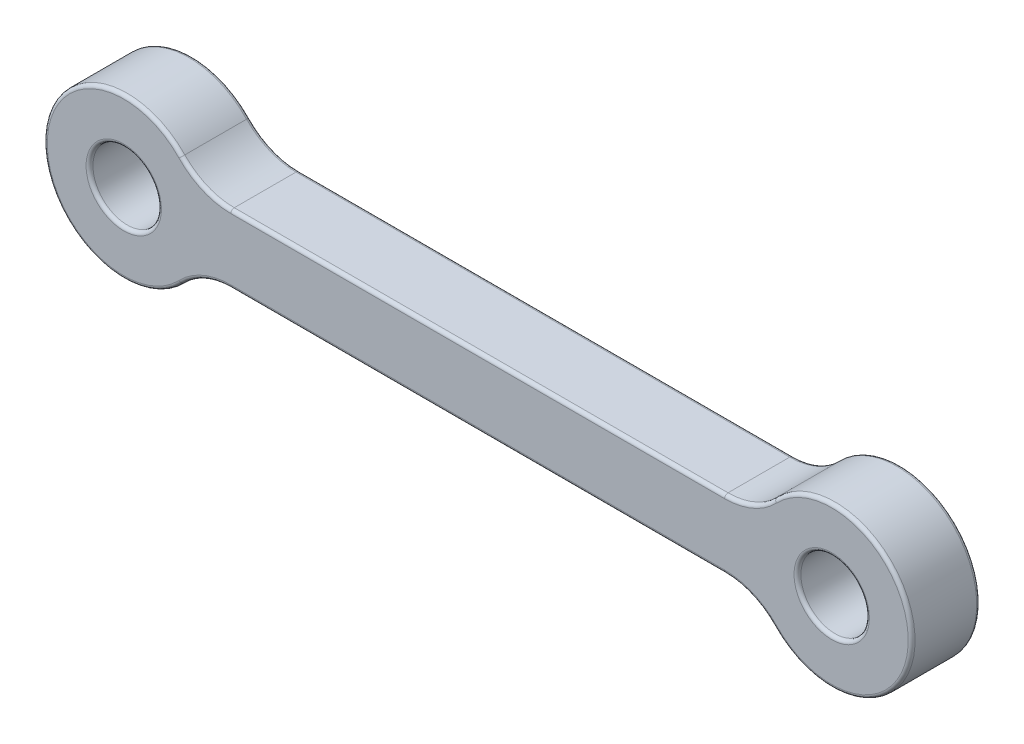
ISO-10303-21;
HEADER;
FILE_DESCRIPTION(('STEP AP214'),'2;1');
FILE_NAME('part.step','',(''),(''),'','','');
FILE_SCHEMA(('AUTOMOTIVE_DESIGN { 1 0 10303 214 1 1 1 1 }'));
ENDSEC;
DATA;
#1=APPLICATION_CONTEXT('core data for automotive mechanical design processes');
#2=APPLICATION_PROTOCOL_DEFINITION('international standard','automotive_design',2000,#1);
#3=PRODUCT_CONTEXT('',#1,'mechanical');
#4=PRODUCT('Part','Part','',(#3));
#5=PRODUCT_RELATED_PRODUCT_CATEGORY('part','',(#4));
#6=PRODUCT_DEFINITION_FORMATION('','',#4);
#7=PRODUCT_DEFINITION_CONTEXT('part definition',#1,'design');
#8=PRODUCT_DEFINITION('design','',#6,#7);
#9=PRODUCT_DEFINITION_SHAPE('','',#8);
#10=(LENGTH_UNIT() NAMED_UNIT(*) SI_UNIT(.MILLI.,.METRE.));
#11=(NAMED_UNIT(*) PLANE_ANGLE_UNIT() SI_UNIT($,.RADIAN.));
#12=(NAMED_UNIT(*) SI_UNIT($,.STERADIAN.) SOLID_ANGLE_UNIT());
#13=UNCERTAINTY_MEASURE_WITH_UNIT(LENGTH_MEASURE(1.E-05),#10,'distance_accuracy_value','');
#14=(GEOMETRIC_REPRESENTATION_CONTEXT(3) GLOBAL_UNCERTAINTY_ASSIGNED_CONTEXT((#13)) GLOBAL_UNIT_ASSIGNED_CONTEXT((#10,
#11,#12)) REPRESENTATION_CONTEXT('',''));
#15=CARTESIAN_POINT('',(0.,0.,0.));
#16=DIRECTION('',(0.,0.,1.));
#17=DIRECTION('',(1.,0.,0.));
#18=AXIS2_PLACEMENT_3D('',#15,#16,#17);
#19=CARTESIAN_POINT('',(0.,1.5,1.5));
#20=DIRECTION('',(0.,-1.,0.));
#21=DIRECTION('',(0.,0.,-1.));
#22=AXIS2_PLACEMENT_3D('',#19,#20,#21);
#23=PLANE('',#22);
#24=DIRECTION('',(0.,0.,-1.));
#25=VECTOR('',#24,1.);
#26=CARTESIAN_POINT('',(26.3095842401766,1.5,1.5));
#27=LINE('',#26,#25);
#28=CARTESIAN_POINT('',(26.3095842401766,1.5,1.35));
#29=VERTEX_POINT('',#28);
#30=CARTESIAN_POINT('',(26.3095842401766,1.5,-1.35));
#31=VERTEX_POINT('',#30);
#32=EDGE_CURVE('E302',#29,#31,#27,.T.);
#33=ORIENTED_EDGE('',*,*,#32,.T.);
#34=DIRECTION('',(-1.,0.,0.));
#35=VECTOR('',#34,1.);
#36=CARTESIAN_POINT('',(0.,1.5,-1.35));
#37=LINE('',#36,#35);
#38=CARTESIAN_POINT('',(4.69041575982343,1.5,-1.35));
#39=VERTEX_POINT('',#38);
#40=EDGE_CURVE('E224',#31,#39,#37,.T.);
#41=ORIENTED_EDGE('',*,*,#40,.T.);
#42=DIRECTION('',(0.,0.,1.));
#43=VECTOR('',#42,1.);
#44=CARTESIAN_POINT('',(4.69041575982343,1.5,1.5));
#45=LINE('',#44,#43);
#46=CARTESIAN_POINT('',(4.69041575982343,1.5,1.35));
#47=VERTEX_POINT('',#46);
#48=EDGE_CURVE('E296',#39,#47,#45,.T.);
#49=ORIENTED_EDGE('',*,*,#48,.T.);
#50=DIRECTION('',(-1.,0.,0.));
#51=VECTOR('',#50,1.);
#52=CARTESIAN_POINT('',(26.3095842401766,1.5,1.35));
#53=LINE('',#52,#51);
#54=EDGE_CURVE('E222',#47,#29,#53,.F.);
#55=ORIENTED_EDGE('',*,*,#54,.T.);
#56=EDGE_LOOP('',(#33,#41,#49,#55));
#57=FACE_BOUND('',#56,.T.);
#58=ADVANCED_FACE('F36',(#57),#23,.F.);
#59=CARTESIAN_POINT('',(0.,0.,1.5));
#60=DIRECTION('',(0.,0.,-1.));
#61=DIRECTION('',(-1.,0.,0.));
#62=AXIS2_PLACEMENT_3D('',#59,#60,#61);
#63=CYLINDRICAL_SURFACE('',#62,3.5);
#64=DIRECTION('',(0.,0.,-1.));
#65=VECTOR('',#64,1.);
#66=CARTESIAN_POINT('',(2.52560848605877,2.42307692307692,1.5));
#67=LINE('',#66,#65);
#68=CARTESIAN_POINT('',(2.52560848605877,2.42307692307692,1.35));
#69=VERTEX_POINT('',#68);
#70=CARTESIAN_POINT('',(2.52560848605877,2.42307692307692,-1.35));
#71=VERTEX_POINT('',#70);
#72=EDGE_CURVE('E298',#69,#71,#67,.T.);
#73=ORIENTED_EDGE('',*,*,#72,.T.);
#74=CARTESIAN_POINT('',(0.,0.,-1.35));
#75=DIRECTION('',(0.,0.,1.));
#76=DIRECTION('',(1.,0.,0.));
#77=AXIS2_PLACEMENT_3D('',#74,#75,#76);
#78=CIRCLE('',#77,3.5);
#79=CARTESIAN_POINT('',(2.52560848605877,-2.42307692307692,-1.35));
#80=VERTEX_POINT('',#79);
#81=EDGE_CURVE('E199',#71,#80,#78,.T.);
#82=ORIENTED_EDGE('',*,*,#81,.T.);
#83=DIRECTION('',(0.,0.,-1.));
#84=VECTOR('',#83,1.);
#85=CARTESIAN_POINT('',(2.52560848605877,-2.42307692307692,1.5));
#86=LINE('',#85,#84);
#87=CARTESIAN_POINT('',(2.52560848605877,-2.42307692307692,1.35));
#88=VERTEX_POINT('',#87);
#89=EDGE_CURVE('E303',#80,#88,#86,.F.);
#90=ORIENTED_EDGE('',*,*,#89,.T.);
#91=CARTESIAN_POINT('',(0.,0.,1.35));
#92=DIRECTION('',(0.,0.,1.));
#93=DIRECTION('',(1.,0.,0.));
#94=AXIS2_PLACEMENT_3D('',#91,#92,#93);
#95=CIRCLE('',#94,3.5);
#96=EDGE_CURVE('E197',#88,#69,#95,.F.);
#97=ORIENTED_EDGE('',*,*,#96,.T.);
#98=EDGE_LOOP('',(#73,#82,#90,#97));
#99=FACE_BOUND('',#98,.T.);
#100=ADVANCED_FACE('F333',(#99),#63,.T.);
#101=CARTESIAN_POINT('',(0.,-1.5,1.5));
#102=DIRECTION('',(0.,-1.,0.));
#103=DIRECTION('',(0.,0.,-1.));
#104=AXIS2_PLACEMENT_3D('',#101,#102,#103);
#105=PLANE('',#104);
#106=DIRECTION('',(0.,0.,-1.));
#107=VECTOR('',#106,1.);
#108=CARTESIAN_POINT('',(4.69041575982343,-1.5,1.5));
#109=LINE('',#108,#107);
#110=CARTESIAN_POINT('',(4.69041575982343,-1.5,1.35));
#111=VERTEX_POINT('',#110);
#112=CARTESIAN_POINT('',(4.69041575982343,-1.5,-1.35));
#113=VERTEX_POINT('',#112);
#114=EDGE_CURVE('E336',#111,#113,#109,.T.);
#115=ORIENTED_EDGE('',*,*,#114,.T.);
#116=DIRECTION('',(-1.,0.,0.));
#117=VECTOR('',#116,1.);
#118=CARTESIAN_POINT('',(26.3095842401766,-1.5,-1.35));
#119=LINE('',#118,#117);
#120=CARTESIAN_POINT('',(26.3095842401766,-1.5,-1.35));
#121=VERTEX_POINT('',#120);
#122=EDGE_CURVE('E207',#113,#121,#119,.F.);
#123=ORIENTED_EDGE('',*,*,#122,.T.);
#124=DIRECTION('',(0.,0.,1.));
#125=VECTOR('',#124,1.);
#126=CARTESIAN_POINT('',(26.3095842401766,-1.5,1.5));
#127=LINE('',#126,#125);
#128=CARTESIAN_POINT('',(26.3095842401766,-1.5,1.35));
#129=VERTEX_POINT('',#128);
#130=EDGE_CURVE('E334',#121,#129,#127,.T.);
#131=ORIENTED_EDGE('',*,*,#130,.T.);
#132=DIRECTION('',(-1.,0.,0.));
#133=VECTOR('',#132,1.);
#134=CARTESIAN_POINT('',(0.,-1.5,1.35));
#135=LINE('',#134,#133);
#136=EDGE_CURVE('E205',#129,#111,#135,.T.);
#137=ORIENTED_EDGE('',*,*,#136,.T.);
#138=EDGE_LOOP('',(#115,#123,#131,#137));
#139=FACE_BOUND('',#138,.T.);
#140=ADVANCED_FACE('F372',(#139),#105,.T.);
#141=CARTESIAN_POINT('',(0.,0.,1.5));
#142=DIRECTION('',(0.,0.,-1.));
#143=DIRECTION('',(-1.,0.,0.));
#144=AXIS2_PLACEMENT_3D('',#141,#142,#143);
#145=CYLINDRICAL_SURFACE('',#144,1.5);
#146=CARTESIAN_POINT('',(0.,0.,-1.35));
#147=DIRECTION('',(0.,0.,1.));
#148=DIRECTION('',(1.,0.,0.));
#149=AXIS2_PLACEMENT_3D('',#146,#147,#148);
#150=CIRCLE('',#149,1.5);
#151=CARTESIAN_POINT('',(1.5,0.,-1.35));
#152=VERTEX_POINT('',#151);
#153=EDGE_CURVE('E191',#152,#152,#150,.F.);
#154=ORIENTED_EDGE('',*,*,#153,.T.);
#155=EDGE_LOOP('',(#154));
#156=FACE_BOUND('',#155,.T.);
#157=CARTESIAN_POINT('',(0.,0.,1.35));
#158=DIRECTION('',(0.,0.,1.));
#159=DIRECTION('',(1.,0.,0.));
#160=AXIS2_PLACEMENT_3D('',#157,#158,#159);
#161=CIRCLE('',#160,1.5);
#162=CARTESIAN_POINT('',(1.5,0.,1.35));
#163=VERTEX_POINT('',#162);
#164=EDGE_CURVE('E188',#163,#163,#161,.T.);
#165=ORIENTED_EDGE('',*,*,#164,.T.);
#166=EDGE_LOOP('',(#165));
#167=FACE_BOUND('',#166,.T.);
#168=ADVANCED_FACE('F639',(#156,#167),#145,.F.);
#169=CARTESIAN_POINT('',(31.,0.,1.5));
#170=DIRECTION('',(0.,0.,-1.));
#171=DIRECTION('',(-1.,0.,0.));
#172=AXIS2_PLACEMENT_3D('',#169,#170,#171);
#173=CYLINDRICAL_SURFACE('',#172,3.5);
#174=DIRECTION('',(0.,0.,-1.));
#175=VECTOR('',#174,1.);
#176=CARTESIAN_POINT('',(28.4743915139412,-2.42307692307692,1.5));
#177=LINE('',#176,#175);
#178=CARTESIAN_POINT('',(28.4743915139412,-2.42307692307692,1.35));
#179=VERTEX_POINT('',#178);
#180=CARTESIAN_POINT('',(28.4743915139412,-2.42307692307692,-1.35));
#181=VERTEX_POINT('',#180);
#182=EDGE_CURVE('E341',#179,#181,#177,.T.);
#183=ORIENTED_EDGE('',*,*,#182,.T.);
#184=CARTESIAN_POINT('',(31.,0.,-1.35));
#185=DIRECTION('',(0.,0.,1.));
#186=DIRECTION('',(1.,0.,0.));
#187=AXIS2_PLACEMENT_3D('',#184,#185,#186);
#188=CIRCLE('',#187,3.5);
#189=CARTESIAN_POINT('',(28.4743915139412,2.42307692307692,-1.35));
#190=VERTEX_POINT('',#189);
#191=EDGE_CURVE('E216',#181,#190,#188,.T.);
#192=ORIENTED_EDGE('',*,*,#191,.T.);
#193=DIRECTION('',(0.,0.,-1.));
#194=VECTOR('',#193,1.);
#195=CARTESIAN_POINT('',(28.4743915139412,2.42307692307692,1.5));
#196=LINE('',#195,#194);
#197=CARTESIAN_POINT('',(28.4743915139412,2.42307692307692,1.35));
#198=VERTEX_POINT('',#197);
#199=EDGE_CURVE('E259',#190,#198,#196,.F.);
#200=ORIENTED_EDGE('',*,*,#199,.T.);
#201=CARTESIAN_POINT('',(31.,0.,1.35));
#202=DIRECTION('',(0.,0.,1.));
#203=DIRECTION('',(1.,0.,0.));
#204=AXIS2_PLACEMENT_3D('',#201,#202,#203);
#205=CIRCLE('',#204,3.5);
#206=EDGE_CURVE('E214',#198,#179,#205,.F.);
#207=ORIENTED_EDGE('',*,*,#206,.T.);
#208=EDGE_LOOP('',(#183,#192,#200,#207));
#209=FACE_BOUND('',#208,.T.);
#210=ADVANCED_FACE('F348',(#209),#173,.T.);
#211=CARTESIAN_POINT('',(31.,0.,1.5));
#212=DIRECTION('',(0.,0.,-1.));
#213=DIRECTION('',(-1.,0.,0.));
#214=AXIS2_PLACEMENT_3D('',#211,#212,#213);
#215=CYLINDRICAL_SURFACE('',#214,1.5);
#216=CARTESIAN_POINT('',(31.,0.,-1.35));
#217=DIRECTION('',(0.,0.,1.));
#218=DIRECTION('',(1.,0.,0.));
#219=AXIS2_PLACEMENT_3D('',#216,#217,#218);
#220=CIRCLE('',#219,1.5);
#221=CARTESIAN_POINT('',(32.5,0.,-1.35));
#222=VERTEX_POINT('',#221);
#223=EDGE_CURVE('E171',#222,#222,#220,.F.);
#224=ORIENTED_EDGE('',*,*,#223,.T.);
#225=EDGE_LOOP('',(#224));
#226=FACE_BOUND('',#225,.T.);
#227=CARTESIAN_POINT('',(31.,0.,1.35));
#228=DIRECTION('',(0.,0.,1.));
#229=DIRECTION('',(1.,0.,0.));
#230=AXIS2_PLACEMENT_3D('',#227,#228,#229);
#231=CIRCLE('',#230,1.5);
#232=CARTESIAN_POINT('',(32.5,0.,1.35));
#233=VERTEX_POINT('',#232);
#234=EDGE_CURVE('E305',#233,#233,#231,.T.);
#235=ORIENTED_EDGE('',*,*,#234,.T.);
#236=EDGE_LOOP('',(#235));
#237=FACE_BOUND('',#236,.T.);
#238=ADVANCED_FACE('F617',(#226,#237),#215,.F.);
#239=CARTESIAN_POINT('',(0.,0.,1.5));
#240=DIRECTION('',(0.,0.,1.));
#241=DIRECTION('',(1.,0.,0.));
#242=AXIS2_PLACEMENT_3D('',#239,#240,#241);
#243=PLANE('',#242);
#244=CARTESIAN_POINT('',(31.,0.,1.5));
#245=DIRECTION('',(0.,0.,1.));
#246=DIRECTION('',(1.,0.,0.));
#247=AXIS2_PLACEMENT_3D('',#244,#245,#246);
#248=CIRCLE('',#247,1.65);
#249=CARTESIAN_POINT('',(32.65,0.,1.5));
#250=VERTEX_POINT('',#249);
#251=EDGE_CURVE('E11',#250,#250,#248,.F.);
#252=ORIENTED_EDGE('',*,*,#251,.T.);
#253=EDGE_LOOP('',(#252));
#254=FACE_BOUND('',#253,.T.);
#255=CARTESIAN_POINT('',(0.,0.,1.5));
#256=DIRECTION('',(0.,0.,1.));
#257=DIRECTION('',(1.,0.,0.));
#258=AXIS2_PLACEMENT_3D('',#255,#256,#257);
#259=CIRCLE('',#258,1.65);
#260=CARTESIAN_POINT('',(1.65,0.,1.5));
#261=VERTEX_POINT('',#260);
#262=EDGE_CURVE('E45',#261,#261,#259,.F.);
#263=ORIENTED_EDGE('',*,*,#262,.T.);
#264=EDGE_LOOP('',(#263));
#265=FACE_BOUND('',#264,.T.);
#266=DIRECTION('',(-1.,0.,0.));
#267=VECTOR('',#266,1.);
#268=CARTESIAN_POINT('',(0.,-1.35,1.5));
#269=LINE('',#268,#267);
#270=CARTESIAN_POINT('',(4.69041575982343,-1.35,1.5));
#271=VERTEX_POINT('',#270);
#272=CARTESIAN_POINT('',(26.3095842401766,-1.35,1.5));
#273=VERTEX_POINT('',#272);
#274=EDGE_CURVE('E53',#271,#273,#269,.F.);
#275=ORIENTED_EDGE('',*,*,#274,.T.);
#276=CARTESIAN_POINT('',(26.3095842401766,-4.5,1.5));
#277=DIRECTION('',(0.,0.,1.));
#278=DIRECTION('',(1.,0.,0.));
#279=AXIS2_PLACEMENT_3D('',#276,#277,#278);
#280=CIRCLE('',#279,3.15);
#281=CARTESIAN_POINT('',(28.5826318776295,-2.31923076923077,1.5));
#282=VERTEX_POINT('',#281);
#283=EDGE_CURVE('E238',#273,#282,#280,.F.);
#284=ORIENTED_EDGE('',*,*,#283,.T.);
#285=CARTESIAN_POINT('',(31.,0.,1.5));
#286=DIRECTION('',(0.,0.,1.));
#287=DIRECTION('',(1.,0.,0.));
#288=AXIS2_PLACEMENT_3D('',#285,#286,#287);
#289=CIRCLE('',#288,3.35);
#290=CARTESIAN_POINT('',(28.5826318776295,2.31923076923077,1.5));
#291=VERTEX_POINT('',#290);
#292=EDGE_CURVE('E226',#282,#291,#289,.T.);
#293=ORIENTED_EDGE('',*,*,#292,.T.);
#294=CARTESIAN_POINT('',(26.3095842401766,4.5,1.5));
#295=DIRECTION('',(0.,0.,1.));
#296=DIRECTION('',(1.,0.,0.));
#297=AXIS2_PLACEMENT_3D('',#294,#295,#296);
#298=CIRCLE('',#297,3.15);
#299=CARTESIAN_POINT('',(26.3095842401766,1.35,1.5));
#300=VERTEX_POINT('',#299);
#301=EDGE_CURVE('E228',#291,#300,#298,.F.);
#302=ORIENTED_EDGE('',*,*,#301,.T.);
#303=DIRECTION('',(-1.,0.,0.));
#304=VECTOR('',#303,1.);
#305=CARTESIAN_POINT('',(4.69041575982343,1.35,1.5));
#306=LINE('',#305,#304);
#307=CARTESIAN_POINT('',(4.69041575982343,1.35,1.5));
#308=VERTEX_POINT('',#307);
#309=EDGE_CURVE('E230',#300,#308,#306,.T.);
#310=ORIENTED_EDGE('',*,*,#309,.T.);
#311=CARTESIAN_POINT('',(4.69041575982343,4.5,1.5));
#312=DIRECTION('',(0.,0.,1.));
#313=DIRECTION('',(1.,0.,0.));
#314=AXIS2_PLACEMENT_3D('',#311,#312,#313);
#315=CIRCLE('',#314,3.15);
#316=CARTESIAN_POINT('',(2.41736812237054,2.31923076923077,1.5));
#317=VERTEX_POINT('',#316);
#318=EDGE_CURVE('E232',#308,#317,#315,.F.);
#319=ORIENTED_EDGE('',*,*,#318,.T.);
#320=CARTESIAN_POINT('',(0.,0.,1.5));
#321=DIRECTION('',(0.,0.,1.));
#322=DIRECTION('',(1.,0.,0.));
#323=AXIS2_PLACEMENT_3D('',#320,#321,#322);
#324=CIRCLE('',#323,3.35);
#325=CARTESIAN_POINT('',(2.41736812237054,-2.31923076923077,1.5));
#326=VERTEX_POINT('',#325);
#327=EDGE_CURVE('E234',#317,#326,#324,.T.);
#328=ORIENTED_EDGE('',*,*,#327,.T.);
#329=CARTESIAN_POINT('',(4.69041575982343,-4.5,1.5));
#330=DIRECTION('',(0.,0.,1.));
#331=DIRECTION('',(1.,0.,0.));
#332=AXIS2_PLACEMENT_3D('',#329,#330,#331);
#333=CIRCLE('',#332,3.15);
#334=EDGE_CURVE('E58',#326,#271,#333,.F.);
#335=ORIENTED_EDGE('',*,*,#334,.T.);
#336=EDGE_LOOP('',(#275,#284,#293,#302,#310,#319,#328,#335));
#337=FACE_BOUND('',#336,.T.);
#338=ADVANCED_FACE('F391',(#254,#265,#337),#243,.T.);
#339=CARTESIAN_POINT('',(0.,0.,-1.5));
#340=DIRECTION('',(0.,0.,1.));
#341=DIRECTION('',(1.,0.,0.));
#342=AXIS2_PLACEMENT_3D('',#339,#340,#341);
#343=PLANE('',#342);
#344=CARTESIAN_POINT('',(31.,0.,-1.5));
#345=DIRECTION('',(0.,0.,1.));
#346=DIRECTION('',(1.,0.,0.));
#347=AXIS2_PLACEMENT_3D('',#344,#345,#346);
#348=CIRCLE('',#347,1.65);
#349=CARTESIAN_POINT('',(32.65,0.,-1.5));
#350=VERTEX_POINT('',#349);
#351=EDGE_CURVE('E180',#350,#350,#348,.T.);
#352=ORIENTED_EDGE('',*,*,#351,.T.);
#353=EDGE_LOOP('',(#352));
#354=FACE_BOUND('',#353,.T.);
#355=CARTESIAN_POINT('',(0.,0.,-1.5));
#356=DIRECTION('',(0.,0.,1.));
#357=DIRECTION('',(1.,0.,0.));
#358=AXIS2_PLACEMENT_3D('',#355,#356,#357);
#359=CIRCLE('',#358,1.65);
#360=CARTESIAN_POINT('',(1.65,0.,-1.5));
#361=VERTEX_POINT('',#360);
#362=EDGE_CURVE('E177',#361,#361,#359,.T.);
#363=ORIENTED_EDGE('',*,*,#362,.T.);
#364=EDGE_LOOP('',(#363));
#365=FACE_BOUND('',#364,.T.);
#366=CARTESIAN_POINT('',(0.,0.,-1.5));
#367=DIRECTION('',(0.,0.,1.));
#368=DIRECTION('',(1.,0.,0.));
#369=AXIS2_PLACEMENT_3D('',#366,#367,#368);
#370=CIRCLE('',#369,3.35);
#371=CARTESIAN_POINT('',(2.41736812237054,-2.31923076923077,-1.5));
#372=VERTEX_POINT('',#371);
#373=CARTESIAN_POINT('',(2.41736812237054,2.31923076923077,-1.5));
#374=VERTEX_POINT('',#373);
#375=EDGE_CURVE('E175',#372,#374,#370,.F.);
#376=ORIENTED_EDGE('',*,*,#375,.T.);
#377=CARTESIAN_POINT('',(4.69041575982343,4.5,-1.5));
#378=DIRECTION('',(0.,0.,1.));
#379=DIRECTION('',(1.,0.,0.));
#380=AXIS2_PLACEMENT_3D('',#377,#378,#379);
#381=CIRCLE('',#380,3.15);
#382=CARTESIAN_POINT('',(4.69041575982343,1.35,-1.5));
#383=VERTEX_POINT('',#382);
#384=EDGE_CURVE('E156',#374,#383,#381,.T.);
#385=ORIENTED_EDGE('',*,*,#384,.T.);
#386=DIRECTION('',(-1.,0.,0.));
#387=VECTOR('',#386,1.);
#388=CARTESIAN_POINT('',(0.,1.35,-1.5));
#389=LINE('',#388,#387);
#390=CARTESIAN_POINT('',(26.3095842401766,1.35,-1.5));
#391=VERTEX_POINT('',#390);
#392=EDGE_CURVE('E164',#383,#391,#389,.F.);
#393=ORIENTED_EDGE('',*,*,#392,.T.);
#394=CARTESIAN_POINT('',(26.3095842401766,4.5,-1.5));
#395=DIRECTION('',(0.,0.,1.));
#396=DIRECTION('',(1.,0.,0.));
#397=AXIS2_PLACEMENT_3D('',#394,#395,#396);
#398=CIRCLE('',#397,3.15);
#399=CARTESIAN_POINT('',(28.5826318776295,2.31923076923077,-1.5));
#400=VERTEX_POINT('',#399);
#401=EDGE_CURVE('E170',#391,#400,#398,.T.);
#402=ORIENTED_EDGE('',*,*,#401,.T.);
#403=CARTESIAN_POINT('',(31.,0.,-1.5));
#404=DIRECTION('',(0.,0.,1.));
#405=DIRECTION('',(1.,0.,0.));
#406=AXIS2_PLACEMENT_3D('',#403,#404,#405);
#407=CIRCLE('',#406,3.35);
#408=CARTESIAN_POINT('',(28.5826318776295,-2.31923076923077,-1.5));
#409=VERTEX_POINT('',#408);
#410=EDGE_CURVE('E316',#400,#409,#407,.F.);
#411=ORIENTED_EDGE('',*,*,#410,.T.);
#412=CARTESIAN_POINT('',(26.3095842401766,-4.5,-1.5));
#413=DIRECTION('',(0.,0.,1.));
#414=DIRECTION('',(1.,0.,0.));
#415=AXIS2_PLACEMENT_3D('',#412,#413,#414);
#416=CIRCLE('',#415,3.15);
#417=CARTESIAN_POINT('',(26.3095842401766,-1.35,-1.5));
#418=VERTEX_POINT('',#417);
#419=EDGE_CURVE('E318',#409,#418,#416,.T.);
#420=ORIENTED_EDGE('',*,*,#419,.T.);
#421=DIRECTION('',(-1.,0.,0.));
#422=VECTOR('',#421,1.);
#423=CARTESIAN_POINT('',(4.69041575982343,-1.35,-1.5));
#424=LINE('',#423,#422);
#425=CARTESIAN_POINT('',(4.69041575982343,-1.35,-1.5));
#426=VERTEX_POINT('',#425);
#427=EDGE_CURVE('E320',#418,#426,#424,.T.);
#428=ORIENTED_EDGE('',*,*,#427,.T.);
#429=CARTESIAN_POINT('',(4.69041575982343,-4.5,-1.5));
#430=DIRECTION('',(0.,0.,1.));
#431=DIRECTION('',(1.,0.,0.));
#432=AXIS2_PLACEMENT_3D('',#429,#430,#431);
#433=CIRCLE('',#432,3.15);
#434=EDGE_CURVE('E182',#426,#372,#433,.T.);
#435=ORIENTED_EDGE('',*,*,#434,.T.);
#436=EDGE_LOOP('',(#376,#385,#393,#402,#411,#420,#428,#435));
#437=FACE_BOUND('',#436,.T.);
#438=ADVANCED_FACE('F173',(#354,#365,#437),#343,.F.);
#439=CARTESIAN_POINT('',(26.3095842401766,-4.5,1.5));
#440=DIRECTION('',(0.,0.,-1.));
#441=DIRECTION('',(-1.,0.,0.));
#442=AXIS2_PLACEMENT_3D('',#439,#440,#441);
#443=CYLINDRICAL_SURFACE('',#442,3.);
#444=ORIENTED_EDGE('',*,*,#130,.F.);
#445=CARTESIAN_POINT('',(26.3095842401766,-4.5,-1.35));
#446=DIRECTION('',(0.,0.,1.));
#447=DIRECTION('',(1.,0.,0.));
#448=AXIS2_PLACEMENT_3D('',#445,#446,#447);
#449=CIRCLE('',#448,3.);
#450=EDGE_CURVE('E212',#121,#181,#449,.F.);
#451=ORIENTED_EDGE('',*,*,#450,.T.);
#452=ORIENTED_EDGE('',*,*,#182,.F.);
#453=CARTESIAN_POINT('',(26.3095842401766,-4.5,1.35));
#454=DIRECTION('',(0.,0.,1.));
#455=DIRECTION('',(1.,0.,0.));
#456=AXIS2_PLACEMENT_3D('',#453,#454,#455);
#457=CIRCLE('',#456,3.);
#458=EDGE_CURVE('E209',#179,#129,#457,.T.);
#459=ORIENTED_EDGE('',*,*,#458,.T.);
#460=EDGE_LOOP('',(#444,#451,#452,#459));
#461=FACE_BOUND('',#460,.T.);
#462=ADVANCED_FACE('F369',(#461),#443,.F.);
#463=CARTESIAN_POINT('',(4.69041575982343,-4.5,1.5));
#464=DIRECTION('',(0.,0.,-1.));
#465=DIRECTION('',(-1.,0.,0.));
#466=AXIS2_PLACEMENT_3D('',#463,#464,#465);
#467=CYLINDRICAL_SURFACE('',#466,3.);
#468=ORIENTED_EDGE('',*,*,#89,.F.);
#469=CARTESIAN_POINT('',(4.69041575982343,-4.5,-1.35));
#470=DIRECTION('',(0.,0.,1.));
#471=DIRECTION('',(1.,0.,0.));
#472=AXIS2_PLACEMENT_3D('',#469,#470,#471);
#473=CIRCLE('',#472,3.);
#474=EDGE_CURVE('E203',#80,#113,#473,.F.);
#475=ORIENTED_EDGE('',*,*,#474,.T.);
#476=ORIENTED_EDGE('',*,*,#114,.F.);
#477=CARTESIAN_POINT('',(4.69041575982343,-4.5,1.35));
#478=DIRECTION('',(0.,0.,1.));
#479=DIRECTION('',(1.,0.,0.));
#480=AXIS2_PLACEMENT_3D('',#477,#478,#479);
#481=CIRCLE('',#480,3.);
#482=EDGE_CURVE('E201',#111,#88,#481,.T.);
#483=ORIENTED_EDGE('',*,*,#482,.T.);
#484=EDGE_LOOP('',(#468,#475,#476,#483));
#485=FACE_BOUND('',#484,.T.);
#486=ADVANCED_FACE('F415',(#485),#467,.F.);
#487=CARTESIAN_POINT('',(26.3095842401766,4.5,1.5));
#488=DIRECTION('',(0.,0.,-1.));
#489=DIRECTION('',(-1.,0.,0.));
#490=AXIS2_PLACEMENT_3D('',#487,#488,#489);
#491=CYLINDRICAL_SURFACE('',#490,3.);
#492=ORIENTED_EDGE('',*,*,#199,.F.);
#493=CARTESIAN_POINT('',(26.3095842401766,4.5,-1.35));
#494=DIRECTION('',(0.,0.,1.));
#495=DIRECTION('',(1.,0.,0.));
#496=AXIS2_PLACEMENT_3D('',#493,#494,#495);
#497=CIRCLE('',#496,3.);
#498=EDGE_CURVE('E220',#190,#31,#497,.F.);
#499=ORIENTED_EDGE('',*,*,#498,.T.);
#500=ORIENTED_EDGE('',*,*,#32,.F.);
#501=CARTESIAN_POINT('',(26.3095842401766,4.5,1.35));
#502=DIRECTION('',(0.,0.,1.));
#503=DIRECTION('',(1.,0.,0.));
#504=AXIS2_PLACEMENT_3D('',#501,#502,#503);
#505=CIRCLE('',#504,3.);
#506=EDGE_CURVE('E218',#29,#198,#505,.T.);
#507=ORIENTED_EDGE('',*,*,#506,.T.);
#508=EDGE_LOOP('',(#492,#499,#500,#507));
#509=FACE_BOUND('',#508,.T.);
#510=ADVANCED_FACE('F388',(#509),#491,.F.);
#511=CARTESIAN_POINT('',(4.69041575982343,4.5,1.5));
#512=DIRECTION('',(0.,0.,-1.));
#513=DIRECTION('',(-1.,0.,0.));
#514=AXIS2_PLACEMENT_3D('',#511,#512,#513);
#515=CYLINDRICAL_SURFACE('',#514,3.);
#516=ORIENTED_EDGE('',*,*,#48,.F.);
#517=CARTESIAN_POINT('',(4.69041575982343,4.5,-1.35));
#518=DIRECTION('',(0.,0.,1.));
#519=DIRECTION('',(1.,0.,0.));
#520=AXIS2_PLACEMENT_3D('',#517,#518,#519);
#521=CIRCLE('',#520,3.);
#522=EDGE_CURVE('E158',#39,#71,#521,.F.);
#523=ORIENTED_EDGE('',*,*,#522,.T.);
#524=ORIENTED_EDGE('',*,*,#72,.F.);
#525=CARTESIAN_POINT('',(4.69041575982343,4.5,1.35));
#526=DIRECTION('',(0.,0.,1.));
#527=DIRECTION('',(1.,0.,0.));
#528=AXIS2_PLACEMENT_3D('',#525,#526,#527);
#529=CIRCLE('',#528,3.);
#530=EDGE_CURVE('E194',#69,#47,#529,.T.);
#531=ORIENTED_EDGE('',*,*,#530,.T.);
#532=EDGE_LOOP('',(#516,#523,#524,#531));
#533=FACE_BOUND('',#532,.T.);
#534=ADVANCED_FACE('F295',(#533),#515,.F.);
#535=CARTESIAN_POINT('',(31.,0.,-1.35));
#536=DIRECTION('',(0.,0.,1.));
#537=DIRECTION('',(1.,0.,0.));
#538=AXIS2_PLACEMENT_3D('',#535,#536,#537);
#539=TOROIDAL_SURFACE('',#538,1.65,0.15);
#540=ORIENTED_EDGE('',*,*,#351,.F.);
#541=EDGE_LOOP('',(#540));
#542=FACE_BOUND('',#541,.T.);
#543=ORIENTED_EDGE('',*,*,#223,.F.);
#544=EDGE_LOOP('',(#543));
#545=FACE_BOUND('',#544,.T.);
#546=ADVANCED_FACE('F423',(#542,#545),#539,.T.);
#547=CARTESIAN_POINT('',(0.,0.,-1.35));
#548=DIRECTION('',(0.,0.,1.));
#549=DIRECTION('',(1.,0.,0.));
#550=AXIS2_PLACEMENT_3D('',#547,#548,#549);
#551=TOROIDAL_SURFACE('',#550,1.65,0.15);
#552=ORIENTED_EDGE('',*,*,#153,.F.);
#553=EDGE_LOOP('',(#552));
#554=FACE_BOUND('',#553,.T.);
#555=ORIENTED_EDGE('',*,*,#362,.F.);
#556=EDGE_LOOP('',(#555));
#557=FACE_BOUND('',#556,.T.);
#558=ADVANCED_FACE('F426',(#554,#557),#551,.T.);
#559=CARTESIAN_POINT('',(26.3095842401766,-4.5,-1.35));
#560=DIRECTION('',(0.,0.,1.));
#561=DIRECTION('',(1.,0.,0.));
#562=AXIS2_PLACEMENT_3D('',#559,#560,#561);
#563=TOROIDAL_SURFACE('',#562,3.15,0.15);
#564=CARTESIAN_POINT('',(28.5826318776295,-2.31923076923077,-1.35));
#565=DIRECTION('',(0.692307692307697,-0.721602424588216,0.));
#566=DIRECTION('',(0.721602424588216,0.692307692307697,0.));
#567=AXIS2_PLACEMENT_3D('',#564,#565,#566);
#568=CIRCLE('',#567,0.15);
#569=EDGE_CURVE('E253',#181,#409,#568,.T.);
#570=ORIENTED_EDGE('',*,*,#569,.F.);
#571=ORIENTED_EDGE('',*,*,#450,.F.);
#572=CARTESIAN_POINT('',(26.3095842401766,-1.35,-1.35));
#573=DIRECTION('',(-1.,0.,0.));
#574=DIRECTION('',(0.,0.,1.));
#575=AXIS2_PLACEMENT_3D('',#572,#573,#574);
#576=CIRCLE('',#575,0.15);
#577=EDGE_CURVE('E256',#418,#121,#576,.T.);
#578=ORIENTED_EDGE('',*,*,#577,.F.);
#579=ORIENTED_EDGE('',*,*,#419,.F.);
#580=EDGE_LOOP('',(#570,#571,#578,#579));
#581=FACE_BOUND('',#580,.T.);
#582=ADVANCED_FACE('F381',(#581),#563,.T.);
#583=CARTESIAN_POINT('',(0.,-1.35,-1.35));
#584=DIRECTION('',(1.,0.,0.));
#585=DIRECTION('',(0.,0.,-1.));
#586=AXIS2_PLACEMENT_3D('',#583,#584,#585);
#587=CYLINDRICAL_SURFACE('',#586,0.15);
#588=ORIENTED_EDGE('',*,*,#577,.T.);
#589=ORIENTED_EDGE('',*,*,#122,.F.);
#590=CARTESIAN_POINT('',(4.69041575982343,-1.35,-1.35));
#591=DIRECTION('',(-1.,0.,0.));
#592=DIRECTION('',(0.,0.,1.));
#593=AXIS2_PLACEMENT_3D('',#590,#591,#592);
#594=CIRCLE('',#593,0.15);
#595=EDGE_CURVE('E250',#426,#113,#594,.T.);
#596=ORIENTED_EDGE('',*,*,#595,.F.);
#597=ORIENTED_EDGE('',*,*,#427,.F.);
#598=EDGE_LOOP('',(#588,#589,#596,#597));
#599=FACE_BOUND('',#598,.T.);
#600=ADVANCED_FACE('F376',(#599),#587,.T.);
#601=CARTESIAN_POINT('',(31.,0.,-1.35));
#602=DIRECTION('',(0.,0.,1.));
#603=DIRECTION('',(1.,0.,0.));
#604=AXIS2_PLACEMENT_3D('',#601,#602,#603);
#605=TOROIDAL_SURFACE('',#604,3.35,0.15);
#606=ORIENTED_EDGE('',*,*,#569,.T.);
#607=ORIENTED_EDGE('',*,*,#410,.F.);
#608=CARTESIAN_POINT('',(28.5826318776295,2.31923076923077,-1.35));
#609=DIRECTION('',(-0.692307692307698,-0.721602424588214,0.));
#610=DIRECTION('',(0.721602424588214,-0.692307692307698,0.));
#611=AXIS2_PLACEMENT_3D('',#608,#609,#610);
#612=CIRCLE('',#611,0.15);
#613=EDGE_CURVE('E247',#190,#400,#612,.T.);
#614=ORIENTED_EDGE('',*,*,#613,.F.);
#615=ORIENTED_EDGE('',*,*,#191,.F.);
#616=EDGE_LOOP('',(#606,#607,#614,#615));
#617=FACE_BOUND('',#616,.T.);
#618=ADVANCED_FACE('F384',(#617),#605,.T.);
#619=CARTESIAN_POINT('',(4.69041575982343,-4.5,-1.35));
#620=DIRECTION('',(0.,0.,1.));
#621=DIRECTION('',(1.,0.,0.));
#622=AXIS2_PLACEMENT_3D('',#619,#620,#621);
#623=TOROIDAL_SURFACE('',#622,3.15,0.15);
#624=ORIENTED_EDGE('',*,*,#595,.T.);
#625=ORIENTED_EDGE('',*,*,#474,.F.);
#626=CARTESIAN_POINT('',(2.41736812237054,-2.31923076923077,-1.35));
#627=DIRECTION('',(-0.692307692307693,-0.72160242458822,0.));
#628=DIRECTION('',(0.72160242458822,-0.692307692307693,0.));
#629=AXIS2_PLACEMENT_3D('',#626,#627,#628);
#630=CIRCLE('',#629,0.15);
#631=EDGE_CURVE('E244',#372,#80,#630,.T.);
#632=ORIENTED_EDGE('',*,*,#631,.F.);
#633=ORIENTED_EDGE('',*,*,#434,.F.);
#634=EDGE_LOOP('',(#624,#625,#632,#633));
#635=FACE_BOUND('',#634,.T.);
#636=ADVANCED_FACE('F327',(#635),#623,.T.);
#637=CARTESIAN_POINT('',(26.3095842401766,4.5,-1.35));
#638=DIRECTION('',(0.,0.,1.));
#639=DIRECTION('',(1.,0.,0.));
#640=AXIS2_PLACEMENT_3D('',#637,#638,#639);
#641=TOROIDAL_SURFACE('',#640,3.15,0.15);
#642=ORIENTED_EDGE('',*,*,#613,.T.);
#643=ORIENTED_EDGE('',*,*,#401,.F.);
#644=CARTESIAN_POINT('',(26.3095842401766,1.35,-1.35));
#645=DIRECTION('',(-1.,0.,0.));
#646=DIRECTION('',(0.,0.,1.));
#647=AXIS2_PLACEMENT_3D('',#644,#645,#646);
#648=CIRCLE('',#647,0.15);
#649=EDGE_CURVE('E167',#31,#391,#648,.T.);
#650=ORIENTED_EDGE('',*,*,#649,.F.);
#651=ORIENTED_EDGE('',*,*,#498,.F.);
#652=EDGE_LOOP('',(#642,#643,#650,#651));
#653=FACE_BOUND('',#652,.T.);
#654=ADVANCED_FACE('F387',(#653),#641,.T.);
#655=CARTESIAN_POINT('',(0.,0.,-1.35));
#656=DIRECTION('',(0.,0.,1.));
#657=DIRECTION('',(1.,0.,0.));
#658=AXIS2_PLACEMENT_3D('',#655,#656,#657);
#659=TOROIDAL_SURFACE('',#658,3.35,0.15);
#660=ORIENTED_EDGE('',*,*,#631,.T.);
#661=ORIENTED_EDGE('',*,*,#81,.F.);
#662=CARTESIAN_POINT('',(2.41736812237054,2.31923076923077,-1.35));
#663=DIRECTION('',(0.692307692307693,-0.72160242458822,0.));
#664=DIRECTION('',(0.72160242458822,0.692307692307693,0.));
#665=AXIS2_PLACEMENT_3D('',#662,#663,#664);
#666=CIRCLE('',#665,0.15);
#667=EDGE_CURVE('E161',#374,#71,#666,.T.);
#668=ORIENTED_EDGE('',*,*,#667,.F.);
#669=ORIENTED_EDGE('',*,*,#375,.F.);
#670=EDGE_LOOP('',(#660,#661,#668,#669));
#671=FACE_BOUND('',#670,.T.);
#672=ADVANCED_FACE('F330',(#671),#659,.T.);
#673=CARTESIAN_POINT('',(0.,1.35,-1.35));
#674=DIRECTION('',(-1.,0.,0.));
#675=DIRECTION('',(0.,0.,1.));
#676=AXIS2_PLACEMENT_3D('',#673,#674,#675);
#677=CYLINDRICAL_SURFACE('',#676,0.15);
#678=ORIENTED_EDGE('',*,*,#649,.T.);
#679=ORIENTED_EDGE('',*,*,#392,.F.);
#680=CARTESIAN_POINT('',(4.69041575982343,1.35,-1.35));
#681=DIRECTION('',(-1.,0.,0.));
#682=DIRECTION('',(0.,0.,1.));
#683=AXIS2_PLACEMENT_3D('',#680,#681,#682);
#684=CIRCLE('',#683,0.15);
#685=EDGE_CURVE('E152',#39,#383,#684,.T.);
#686=ORIENTED_EDGE('',*,*,#685,.F.);
#687=ORIENTED_EDGE('',*,*,#40,.F.);
#688=EDGE_LOOP('',(#678,#679,#686,#687));
#689=FACE_BOUND('',#688,.T.);
#690=ADVANCED_FACE('F165',(#689),#677,.T.);
#691=CARTESIAN_POINT('',(4.69041575982343,4.5,-1.35));
#692=DIRECTION('',(0.,0.,1.));
#693=DIRECTION('',(1.,0.,0.));
#694=AXIS2_PLACEMENT_3D('',#691,#692,#693);
#695=TOROIDAL_SURFACE('',#694,3.15,0.15);
#696=ORIENTED_EDGE('',*,*,#667,.T.);
#697=ORIENTED_EDGE('',*,*,#522,.F.);
#698=ORIENTED_EDGE('',*,*,#685,.T.);
#699=ORIENTED_EDGE('',*,*,#384,.F.);
#700=EDGE_LOOP('',(#696,#697,#698,#699));
#701=FACE_BOUND('',#700,.T.);
#702=ADVANCED_FACE('F154',(#701),#695,.T.);
#703=CARTESIAN_POINT('',(31.,0.,1.35));
#704=DIRECTION('',(0.,0.,1.));
#705=DIRECTION('',(1.,0.,0.));
#706=AXIS2_PLACEMENT_3D('',#703,#704,#705);
#707=TOROIDAL_SURFACE('',#706,1.65,0.15);
#708=ORIENTED_EDGE('',*,*,#234,.F.);
#709=EDGE_LOOP('',(#708));
#710=FACE_BOUND('',#709,.T.);
#711=ORIENTED_EDGE('',*,*,#251,.F.);
#712=EDGE_LOOP('',(#711));
#713=FACE_BOUND('',#712,.T.);
#714=ADVANCED_FACE('F433',(#710,#713),#707,.T.);
#715=CARTESIAN_POINT('',(0.,0.,1.35));
#716=DIRECTION('',(0.,0.,1.));
#717=DIRECTION('',(1.,0.,0.));
#718=AXIS2_PLACEMENT_3D('',#715,#716,#717);
#719=TOROIDAL_SURFACE('',#718,1.65,0.15);
#720=ORIENTED_EDGE('',*,*,#262,.F.);
#721=EDGE_LOOP('',(#720));
#722=FACE_BOUND('',#721,.T.);
#723=ORIENTED_EDGE('',*,*,#164,.F.);
#724=EDGE_LOOP('',(#723));
#725=FACE_BOUND('',#724,.T.);
#726=ADVANCED_FACE('F450',(#722,#725),#719,.T.);
#727=CARTESIAN_POINT('',(4.69041575982343,4.5,1.35));
#728=DIRECTION('',(0.,0.,1.));
#729=DIRECTION('',(1.,0.,0.));
#730=AXIS2_PLACEMENT_3D('',#727,#728,#729);
#731=TOROIDAL_SURFACE('',#730,3.15,0.15);
#732=CARTESIAN_POINT('',(4.69041575982343,1.35,1.35));
#733=DIRECTION('',(1.,0.,0.));
#734=DIRECTION('',(0.,0.,-1.));
#735=AXIS2_PLACEMENT_3D('',#732,#733,#734);
#736=CIRCLE('',#735,0.15);
#737=EDGE_CURVE('E275',#47,#308,#736,.T.);
#738=ORIENTED_EDGE('',*,*,#737,.F.);
#739=ORIENTED_EDGE('',*,*,#530,.F.);
#740=CARTESIAN_POINT('',(2.41736812237054,2.31923076923077,1.35));
#741=DIRECTION('',(-0.692307692307693,0.72160242458822,0.));
#742=DIRECTION('',(-0.72160242458822,-0.692307692307693,0.));
#743=AXIS2_PLACEMENT_3D('',#740,#741,#742);
#744=CIRCLE('',#743,0.15);
#745=EDGE_CURVE('E40',#317,#69,#744,.T.);
#746=ORIENTED_EDGE('',*,*,#745,.F.);
#747=ORIENTED_EDGE('',*,*,#318,.F.);
#748=EDGE_LOOP('',(#738,#739,#746,#747));
#749=FACE_BOUND('',#748,.T.);
#750=ADVANCED_FACE('F38',(#749),#731,.T.);
#751=CARTESIAN_POINT('',(0.,0.,1.35));
#752=DIRECTION('',(0.,0.,1.));
#753=DIRECTION('',(1.,0.,0.));
#754=AXIS2_PLACEMENT_3D('',#751,#752,#753);
#755=TOROIDAL_SURFACE('',#754,3.35,0.15);
#756=ORIENTED_EDGE('',*,*,#745,.T.);
#757=ORIENTED_EDGE('',*,*,#96,.F.);
#758=CARTESIAN_POINT('',(2.41736812237054,-2.31923076923077,1.35));
#759=DIRECTION('',(0.692307692307693,0.72160242458822,0.));
#760=DIRECTION('',(-0.72160242458822,0.692307692307693,0.));
#761=AXIS2_PLACEMENT_3D('',#758,#759,#760);
#762=CIRCLE('',#761,0.15);
#763=EDGE_CURVE('E273',#326,#88,#762,.T.);
#764=ORIENTED_EDGE('',*,*,#763,.F.);
#765=ORIENTED_EDGE('',*,*,#327,.F.);
#766=EDGE_LOOP('',(#756,#757,#764,#765));
#767=FACE_BOUND('',#766,.T.);
#768=ADVANCED_FACE('F286',(#767),#755,.T.);
#769=CARTESIAN_POINT('',(0.,1.35,1.35));
#770=DIRECTION('',(1.,0.,0.));
#771=DIRECTION('',(0.,0.,-1.));
#772=AXIS2_PLACEMENT_3D('',#769,#770,#771);
#773=CYLINDRICAL_SURFACE('',#772,0.15);
#774=ORIENTED_EDGE('',*,*,#737,.T.);
#775=ORIENTED_EDGE('',*,*,#309,.F.);
#776=CARTESIAN_POINT('',(26.3095842401766,1.35,1.35));
#777=DIRECTION('',(1.,0.,0.));
#778=DIRECTION('',(0.,0.,-1.));
#779=AXIS2_PLACEMENT_3D('',#776,#777,#778);
#780=CIRCLE('',#779,0.15);
#781=EDGE_CURVE('E270',#29,#300,#780,.T.);
#782=ORIENTED_EDGE('',*,*,#781,.F.);
#783=ORIENTED_EDGE('',*,*,#54,.F.);
#784=EDGE_LOOP('',(#774,#775,#782,#783));
#785=FACE_BOUND('',#784,.T.);
#786=ADVANCED_FACE('F390',(#785),#773,.T.);
#787=CARTESIAN_POINT('',(4.69041575982343,-4.5,1.35));
#788=DIRECTION('',(0.,0.,1.));
#789=DIRECTION('',(1.,0.,0.));
#790=AXIS2_PLACEMENT_3D('',#787,#788,#789);
#791=TOROIDAL_SURFACE('',#790,3.15,0.15);
#792=ORIENTED_EDGE('',*,*,#763,.T.);
#793=ORIENTED_EDGE('',*,*,#482,.F.);
#794=CARTESIAN_POINT('',(4.69041575982343,-1.35,1.35));
#795=DIRECTION('',(1.,0.,0.));
#796=DIRECTION('',(0.,0.,-1.));
#797=AXIS2_PLACEMENT_3D('',#794,#795,#796);
#798=CIRCLE('',#797,0.15);
#799=EDGE_CURVE('E267',#271,#111,#798,.T.);
#800=ORIENTED_EDGE('',*,*,#799,.F.);
#801=ORIENTED_EDGE('',*,*,#334,.F.);
#802=EDGE_LOOP('',(#792,#793,#800,#801));
#803=FACE_BOUND('',#802,.T.);
#804=ADVANCED_FACE('F394',(#803),#791,.T.);
#805=CARTESIAN_POINT('',(26.3095842401766,4.5,1.35));
#806=DIRECTION('',(0.,0.,1.));
#807=DIRECTION('',(1.,0.,0.));
#808=AXIS2_PLACEMENT_3D('',#805,#806,#807);
#809=TOROIDAL_SURFACE('',#808,3.15,0.15);
#810=ORIENTED_EDGE('',*,*,#781,.T.);
#811=ORIENTED_EDGE('',*,*,#301,.F.);
#812=CARTESIAN_POINT('',(28.5826318776295,2.31923076923077,1.35));
#813=DIRECTION('',(0.692307692307697,0.721602424588216,0.));
#814=DIRECTION('',(-0.721602424588216,0.692307692307697,0.));
#815=AXIS2_PLACEMENT_3D('',#812,#813,#814);
#816=CIRCLE('',#815,0.15);
#817=EDGE_CURVE('E264',#198,#291,#816,.T.);
#818=ORIENTED_EDGE('',*,*,#817,.F.);
#819=ORIENTED_EDGE('',*,*,#506,.F.);
#820=EDGE_LOOP('',(#810,#811,#818,#819));
#821=FACE_BOUND('',#820,.T.);
#822=ADVANCED_FACE('F357',(#821),#809,.T.);
#823=CARTESIAN_POINT('',(0.,-1.35,1.35));
#824=DIRECTION('',(-1.,0.,0.));
#825=DIRECTION('',(0.,0.,1.));
#826=AXIS2_PLACEMENT_3D('',#823,#824,#825);
#827=CYLINDRICAL_SURFACE('',#826,0.15);
#828=ORIENTED_EDGE('',*,*,#799,.T.);
#829=ORIENTED_EDGE('',*,*,#136,.F.);
#830=CARTESIAN_POINT('',(26.3095842401766,-1.35,1.35));
#831=DIRECTION('',(1.,0.,0.));
#832=DIRECTION('',(0.,0.,-1.));
#833=AXIS2_PLACEMENT_3D('',#830,#831,#832);
#834=CIRCLE('',#833,0.15);
#835=EDGE_CURVE('E262',#273,#129,#834,.T.);
#836=ORIENTED_EDGE('',*,*,#835,.F.);
#837=ORIENTED_EDGE('',*,*,#274,.F.);
#838=EDGE_LOOP('',(#828,#829,#836,#837));
#839=FACE_BOUND('',#838,.T.);
#840=ADVANCED_FACE('F396',(#839),#827,.T.);
#841=CARTESIAN_POINT('',(31.,0.,1.35));
#842=DIRECTION('',(0.,0.,1.));
#843=DIRECTION('',(1.,0.,0.));
#844=AXIS2_PLACEMENT_3D('',#841,#842,#843);
#845=TOROIDAL_SURFACE('',#844,3.35,0.15);
#846=ORIENTED_EDGE('',*,*,#817,.T.);
#847=ORIENTED_EDGE('',*,*,#292,.F.);
#848=CARTESIAN_POINT('',(28.5826318776295,-2.31923076923077,1.35));
#849=DIRECTION('',(-0.692307692307698,0.721602424588214,0.));
#850=DIRECTION('',(-0.721602424588214,-0.692307692307698,0.));
#851=AXIS2_PLACEMENT_3D('',#848,#849,#850);
#852=CIRCLE('',#851,0.15);
#853=EDGE_CURVE('E260',#179,#282,#852,.T.);
#854=ORIENTED_EDGE('',*,*,#853,.F.);
#855=ORIENTED_EDGE('',*,*,#206,.F.);
#856=EDGE_LOOP('',(#846,#847,#854,#855));
#857=FACE_BOUND('',#856,.T.);
#858=ADVANCED_FACE('F361',(#857),#845,.T.);
#859=CARTESIAN_POINT('',(26.3095842401766,-4.5,1.35));
#860=DIRECTION('',(0.,0.,1.));
#861=DIRECTION('',(1.,0.,0.));
#862=AXIS2_PLACEMENT_3D('',#859,#860,#861);
#863=TOROIDAL_SURFACE('',#862,3.15,0.15);
#864=ORIENTED_EDGE('',*,*,#835,.T.);
#865=ORIENTED_EDGE('',*,*,#458,.F.);
#866=ORIENTED_EDGE('',*,*,#853,.T.);
#867=ORIENTED_EDGE('',*,*,#283,.F.);
#868=EDGE_LOOP('',(#864,#865,#866,#867));
#869=FACE_BOUND('',#868,.T.);
#870=ADVANCED_FACE('F365',(#869),#863,.T.);
#871=CLOSED_SHELL('',(#58,#100,#140,#168,#210,#238,#338,#438,#462,#486,#510,#534,#546,#558,#582,
#600,#618,#636,#654,#672,#690,#702,#714,#726,#750,#768,#786,#804,#822,#840,#858,#870));
#872=MANIFOLD_SOLID_BREP('B2',#871);
#873=ADVANCED_BREP_SHAPE_REPRESENTATION('',(#18,#872),#14);
#874=SHAPE_DEFINITION_REPRESENTATION(#9,#873);
ENDSEC;
END-ISO-10303-21;
